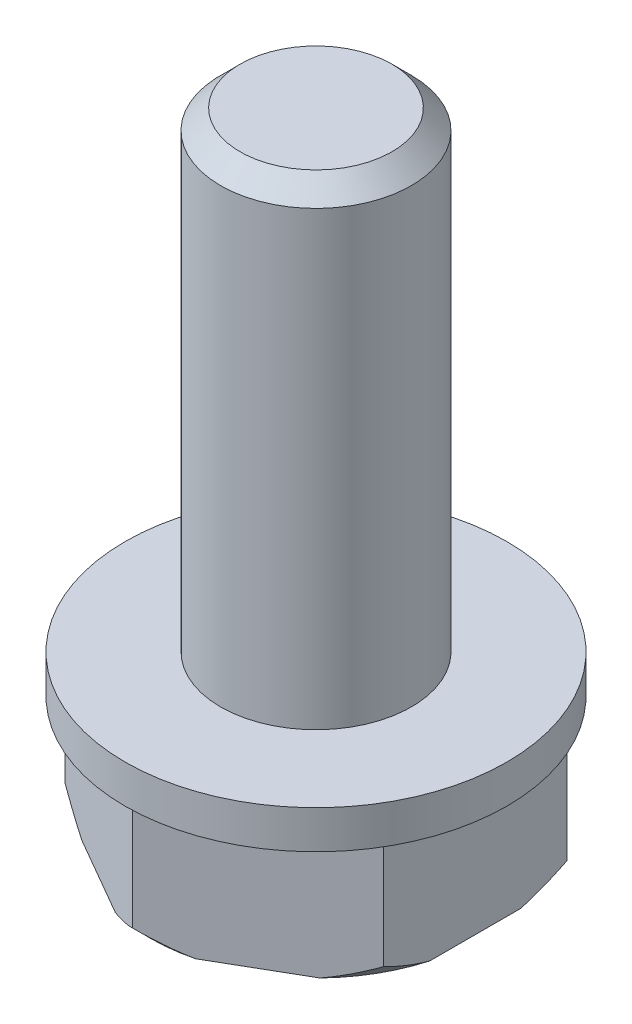
ISO-10303-21;
HEADER;
FILE_DESCRIPTION(('STEP AP214'),'2;1');
FILE_NAME('part.step','',(''),(''),'','','');
FILE_SCHEMA(('AUTOMOTIVE_DESIGN { 1 0 10303 214 1 1 1 1 }'));
ENDSEC;
DATA;
#1=APPLICATION_CONTEXT('core data for automotive mechanical design processes');
#2=APPLICATION_PROTOCOL_DEFINITION('international standard','automotive_design',2000,#1);
#3=PRODUCT_CONTEXT('',#1,'mechanical');
#4=PRODUCT('Part','Part','',(#3));
#5=PRODUCT_RELATED_PRODUCT_CATEGORY('part','',(#4));
#6=PRODUCT_DEFINITION_FORMATION('','',#4);
#7=PRODUCT_DEFINITION_CONTEXT('part definition',#1,'design');
#8=PRODUCT_DEFINITION('design','',#6,#7);
#9=PRODUCT_DEFINITION_SHAPE('','',#8);
#10=(LENGTH_UNIT() NAMED_UNIT(*) SI_UNIT(.MILLI.,.METRE.));
#11=(NAMED_UNIT(*) PLANE_ANGLE_UNIT() SI_UNIT($,.RADIAN.));
#12=(NAMED_UNIT(*) SI_UNIT($,.STERADIAN.) SOLID_ANGLE_UNIT());
#13=UNCERTAINTY_MEASURE_WITH_UNIT(LENGTH_MEASURE(1.E-05),#10,'distance_accuracy_value','');
#14=(GEOMETRIC_REPRESENTATION_CONTEXT(3) GLOBAL_UNCERTAINTY_ASSIGNED_CONTEXT((#13)) GLOBAL_UNIT_ASSIGNED_CONTEXT((#10,
#11,#12)) REPRESENTATION_CONTEXT('',''));
#15=CARTESIAN_POINT('',(0.,0.,0.));
#16=DIRECTION('',(0.,0.,1.));
#17=DIRECTION('',(1.,0.,0.));
#18=AXIS2_PLACEMENT_3D('',#15,#16,#17);
#19=CARTESIAN_POINT('',(22.6776695296637,96.,14.7909181837156));
#20=DIRECTION('',(-0.5,0.,0.866025403784439));
#21=DIRECTION('',(0.866025403784439,0.,0.5));
#22=AXIS2_PLACEMENT_3D('',#19,#20,#21);
#23=PLANE('',#22);
#24=DIRECTION('',(0.,-1.,0.));
#25=VECTOR('',#24,1.);
#26=CARTESIAN_POINT('',(22.6776695296637,96.,14.7909181837156));
#27=LINE('',#26,#25);
#28=CARTESIAN_POINT('',(22.6776695296637,50.,14.7909181837156));
#29=VERTEX_POINT('',#28);
#30=CARTESIAN_POINT('',(22.6776695296637,46.5735026918963,14.7909181837156));
#31=VERTEX_POINT('',#30);
#32=EDGE_CURVE('E11',#29,#31,#27,.T.);
#33=ORIENTED_EDGE('',*,*,#32,.T.);
#34=CARTESIAN_POINT('',(21.414601217349,46.,14.0616853535958));
#35=CARTESIAN_POINT('',(21.4664537594648,46.0164440766261,14.091623938227));
#36=CARTESIAN_POINT('',(21.5180895158105,46.0337687545802,14.1214486324146));
#37=CARTESIAN_POINT('',(21.6214874574526,46.0702823086314,14.1811796574282));
#38=CARTESIAN_POINT('',(21.6732446970938,46.0894897238432,14.2110832271335));
#39=CARTESIAN_POINT('',(21.7769756621481,46.1297670931507,14.2710096812821));
#40=CARTESIAN_POINT('',(21.8289432219275,46.1508582920278,14.3010289273304));
#41=CARTESIAN_POINT('',(21.9331790081629,46.1949003649628,14.3612296351021));
#42=CARTESIAN_POINT('',(21.9854399260141,46.2178745106764,14.3914067018588));
#43=CARTESIAN_POINT('',(22.0903392794409,46.2656807395659,14.4519664939412));
#44=CARTESIAN_POINT('',(22.1429693499514,46.2905375181192,14.4823441822286));
#45=CARTESIAN_POINT('',(22.2486773209186,46.3421079012049,14.5433494931069));
#46=CARTESIAN_POINT('',(22.3017459168783,46.3688470805479,14.5739715894766));
#47=CARTESIAN_POINT('',(22.4083946755418,46.4241810640024,14.6355096377957));
#48=CARTESIAN_POINT('',(22.4619647196343,46.4528018406309,14.6664197250956));
#49=CARTESIAN_POINT('',(22.56967482855,46.5119007649667,14.7285774640249));
#50=CARTESIAN_POINT('',(22.6238041115768,46.5424049416879,14.7598190718213));
#51=CARTESIAN_POINT('',(22.6776695296637,46.5735026918963,14.7909181837156));
#52=B_SPLINE_CURVE_WITH_KNOTS('',3,(#34,#35,#36,#37,#38,#39,#40,#41,#42,#43,#44,#45,#46,#47,#48,
#49,#50,#51),.UNSPECIFIED.,.F.,.F.,(4,2,2,2,2,2,2,2,4),(0.,0.186265222277087,0.374595608167021,
0.565412784427934,0.759111232115696,0.956057798253862,1.15659171756842,1.36102506604504,
1.56964356219137),.UNSPECIFIED.);
#53=CARTESIAN_POINT('',(21.414601217349,46.,14.0616853535958));
#54=VERTEX_POINT('',#53);
#55=EDGE_CURVE('E258',#54,#31,#52,.T.);
#56=ORIENTED_EDGE('',*,*,#55,.F.);
#57=DIRECTION('',(0.866025403784439,0.,0.5));
#58=VECTOR('',#57,1.);
#59=CARTESIAN_POINT('',(24.0776695296637,46.,15.5992085605811));
#60=LINE('',#59,#58);
#61=CARTESIAN_POINT('',(18.9407378419784,46.,12.6333996678872));
#62=VERTEX_POINT('',#61);
#63=EDGE_CURVE('E263',#62,#54,#60,.T.);
#64=ORIENTED_EDGE('',*,*,#63,.F.);
#65=CARTESIAN_POINT('',(17.6776695296637,46.5735026918963,11.9041668377674));
#66=CARTESIAN_POINT('',(17.7315348596427,46.542404941688,11.9352661022691));
#67=CARTESIAN_POINT('',(17.7856555271629,46.5119007649667,11.9665226325607));
#68=CARTESIAN_POINT('',(17.8933407625753,46.4528018406309,12.0287234536614));
#69=CARTESIAN_POINT('',(17.9468947054565,46.4241810640024,12.0596614290774));
#70=CARTESIAN_POINT('',(18.0535125979319,46.3688470805479,12.1212529392026));
#71=CARTESIAN_POINT('',(18.1065664092851,46.3421079012049,12.1519006432619));
#72=CARTESIAN_POINT('',(18.212252543755,46.2905375181192,12.2129437760629));
#73=CARTESIAN_POINT('',(18.2648754287754,46.2656807395659,12.2433339099843));
#74=CARTESIAN_POINT('',(18.3697714238801,46.2178745106764,12.3038995188512));
#75=CARTESIAN_POINT('',(18.4220359892286,46.1949003649628,12.3340702679571));
#76=CARTESIAN_POINT('',(18.5262892246024,46.1508582920278,12.3942407529346));
#77=CARTESIAN_POINT('',(18.5782704341725,46.1297670931507,12.424236356852));
#78=CARTESIAN_POINT('',(18.682033748351,46.0894897238432,12.4841067806739));
#79=CARTESIAN_POINT('',(18.7338096192003,46.0702823086314,12.5139780801803));
#80=CARTESIAN_POINT('',(18.8372371750771,46.0337687545802,12.5736578118346));
#81=CARTESIAN_POINT('',(18.8888839960765,46.0164440766261,12.6034633414798));
#82=CARTESIAN_POINT('',(18.9407378419784,46.,12.6333996678872));
#83=B_SPLINE_CURVE_WITH_KNOTS('',3,(#65,#66,#67,#68,#69,#70,#71,#72,#73,#74,#75,#76,#77,#78,#79,
#80,#81,#82),.UNSPECIFIED.,.F.,.F.,(4,2,2,2,2,2,2,2,4),(0.,0.208618496146341,0.41305184462297,
0.61358576393753,0.810532330075703,1.00423077776347,1.19504795402438,1.38337833991431,
1.56964356219139),.UNSPECIFIED.);
#84=CARTESIAN_POINT('',(17.6776695296637,46.5735026918963,11.9041668377674));
#85=VERTEX_POINT('',#84);
#86=EDGE_CURVE('E385',#85,#62,#83,.T.);
#87=ORIENTED_EDGE('',*,*,#86,.F.);
#88=DIRECTION('',(0.,-1.,0.));
#89=VECTOR('',#88,1.);
#90=CARTESIAN_POINT('',(17.6776695296637,96.,11.9041668377674));
#91=LINE('',#90,#89);
#92=CARTESIAN_POINT('',(17.6776695296637,50.,11.9041668377674));
#93=VERTEX_POINT('',#92);
#94=EDGE_CURVE('E283',#93,#85,#91,.T.);
#95=ORIENTED_EDGE('',*,*,#94,.F.);
#96=DIRECTION('',(-0.866025403784439,0.,-0.5));
#97=VECTOR('',#96,1.);
#98=CARTESIAN_POINT('',(22.4276695296637,50.,14.6465806164181));
#99=LINE('',#98,#97);
#100=EDGE_CURVE('E396',#29,#93,#99,.T.);
#101=ORIENTED_EDGE('',*,*,#100,.F.);
#102=EDGE_LOOP('',(#33,#56,#64,#87,#95,#101));
#103=FACE_BOUND('',#102,.T.);
#104=ADVANCED_FACE('F16',(#103),#23,.F.);
#105=CARTESIAN_POINT('',(22.6776695296637,96.,20.5644208756118));
#106=DIRECTION('',(-1.,0.,0.));
#107=DIRECTION('',(0.,0.,1.));
#108=AXIS2_PLACEMENT_3D('',#105,#106,#107);
#109=PLANE('',#108);
#110=DIRECTION('',(0.,-1.,0.));
#111=VECTOR('',#110,1.);
#112=CARTESIAN_POINT('',(22.6776695296637,96.,20.5644208756118));
#113=LINE('',#112,#111);
#114=CARTESIAN_POINT('',(22.6776695296637,50.,20.5644208756118));
#115=VERTEX_POINT('',#114);
#116=CARTESIAN_POINT('',(22.6776695296637,46.5735026918963,20.5644208756118));
#117=VERTEX_POINT('',#116);
#118=EDGE_CURVE('E212',#115,#117,#113,.T.);
#119=ORIENTED_EDGE('',*,*,#118,.T.);
#120=CARTESIAN_POINT('',(22.6776695296637,46.,19.1059552153723));
#121=CARTESIAN_POINT('',(22.6776682258776,46.0164440766261,19.1658301264109));
#122=CARTESIAN_POINT('',(22.6776571612239,46.0337687545802,19.2254603502437));
#123=CARTESIAN_POINT('',(22.6776275469891,46.0702823086314,19.3448711069116));
#124=CARTESIAN_POINT('',(22.6776089157811,46.0894897238432,19.4046459761233));
#125=CARTESIAN_POINT('',(22.6775765666569,46.1297670931507,19.5244428540937));
#126=CARTESIAN_POINT('',(22.6775629168662,46.1508582920278,19.5844577040596));
#127=CARTESIAN_POINT('',(22.6775454677278,46.1949003649628,19.7048288968087));
#128=CARTESIAN_POINT('',(22.6775418202304,46.2178745106764,19.7651767126713));
#129=CARTESIAN_POINT('',(22.6775451785526,46.2656807395659,19.8863021136206));
#130=CARTESIAN_POINT('',(22.6775523640427,46.2905375181192,19.9470699358293));
#131=CARTESIAN_POINT('',(22.67757420054,46.3421079012049,20.0691183795086));
#132=CARTESIAN_POINT('',(22.6775889851464,46.3688470805479,20.1303881799377));
#133=CARTESIAN_POINT('',(22.6776198513346,46.4241810640024,20.2535177383819));
#134=CARTESIAN_POINT('',(22.677635952546,46.4528018406309,20.3153658010979));
#135=CARTESIAN_POINT('',(22.6776608260492,46.5119007649667,20.4397243611279));
#136=CARTESIAN_POINT('',(22.6776694415558,46.542404941688,20.502222499216));
#137=CARTESIAN_POINT('',(22.6776695296637,46.5735026918963,20.5644208756118));
#138=B_SPLINE_CURVE_WITH_KNOTS('',3,(#120,#121,#122,#123,#124,#125,#126,#127,#128,#129,#130,
#131,#132,#133,#134,#135,#136,#137),.UNSPECIFIED.,.F.,.F.,(4,2,2,2,2,2,2,2,4),(0.,
0.186265222277086,0.37459560816702,0.565412784427932,0.759111232115696,0.956057798253867,
1.15659171756843,1.36102506604505,1.56964356219139),.UNSPECIFIED.);
#139=CARTESIAN_POINT('',(22.6776695296637,46.,19.1059552153723));
#140=VERTEX_POINT('',#139);
#141=EDGE_CURVE('E29',#140,#117,#138,.T.);
#142=ORIENTED_EDGE('',*,*,#141,.F.);
#143=DIRECTION('',(0.,0.,1.));
#144=VECTOR('',#143,1.);
#145=CARTESIAN_POINT('',(22.6776695296637,46.,17.6776695296637));
#146=LINE('',#145,#144);
#147=CARTESIAN_POINT('',(22.6776695296637,46.,16.2493838439551));
#148=VERTEX_POINT('',#147);
#149=EDGE_CURVE('E196',#148,#140,#146,.T.);
#150=ORIENTED_EDGE('',*,*,#149,.F.);
#151=CARTESIAN_POINT('',(22.6776695296637,46.5735026918963,14.7909181837156));
#152=CARTESIAN_POINT('',(22.6776694415558,46.5424049416879,14.8531165601115));
#153=CARTESIAN_POINT('',(22.6776608260492,46.5119007649667,14.9156146981996));
#154=CARTESIAN_POINT('',(22.677635952546,46.4528018406309,15.0399732582295));
#155=CARTESIAN_POINT('',(22.6776198513346,46.4241810640024,15.1018213209455));
#156=CARTESIAN_POINT('',(22.6775889851464,46.3688470805479,15.2249508793897));
#157=CARTESIAN_POINT('',(22.67757420054,46.3421079012049,15.2862206798188));
#158=CARTESIAN_POINT('',(22.6775523640427,46.2905375181192,15.4082691234981));
#159=CARTESIAN_POINT('',(22.6775451785526,46.2656807395659,15.4690369457068));
#160=CARTESIAN_POINT('',(22.6775418202304,46.2178745106764,15.5901623466562));
#161=CARTESIAN_POINT('',(22.6775454677278,46.1949003649628,15.6505101625187));
#162=CARTESIAN_POINT('',(22.6775629168662,46.1508582920278,15.7708813552679));
#163=CARTESIAN_POINT('',(22.6775765666568,46.1297670931507,15.8308962052337));
#164=CARTESIAN_POINT('',(22.6776089157811,46.0894897238432,15.9506930832041));
#165=CARTESIAN_POINT('',(22.6776275469891,46.0702823086314,16.0104679524158));
#166=CARTESIAN_POINT('',(22.6776571612239,46.0337687545802,16.1298787090837));
#167=CARTESIAN_POINT('',(22.6776682258776,46.0164440766261,16.1895089329165));
#168=CARTESIAN_POINT('',(22.6776695296637,46.,16.2493838439551));
#169=B_SPLINE_CURVE_WITH_KNOTS('',3,(#151,#152,#153,#154,#155,#156,#157,#158,#159,#160,#161,
#162,#163,#164,#165,#166,#167,#168),.UNSPECIFIED.,.F.,.F.,(4,2,2,2,2,2,2,2,4),(0.,
0.208618496146355,0.413051844622992,0.613585763937557,0.810532330075726,1.00423077776349,
1.19504795402439,1.38337833991431,1.56964356219138),.UNSPECIFIED.);
#170=EDGE_CURVE('E223',#31,#148,#169,.T.);
#171=ORIENTED_EDGE('',*,*,#170,.F.);
#172=ORIENTED_EDGE('',*,*,#32,.F.);
#173=DIRECTION('',(0.,0.,-1.));
#174=VECTOR('',#173,1.);
#175=CARTESIAN_POINT('',(22.6776695296637,50.,17.6776695296637));
#176=LINE('',#175,#174);
#177=EDGE_CURVE('E393',#115,#29,#176,.T.);
#178=ORIENTED_EDGE('',*,*,#177,.F.);
#179=EDGE_LOOP('',(#119,#142,#150,#171,#172,#178));
#180=FACE_BOUND('',#179,.T.);
#181=ADVANCED_FACE('F273',(#180),#109,.F.);
#182=CARTESIAN_POINT('',(17.6776695296637,46.8,17.6776695296637));
#183=DIRECTION('',(0.,1.,0.));
#184=DIRECTION('',(0.,0.,1.));
#185=AXIS2_PLACEMENT_3D('',#182,#183,#184);
#186=CONICAL_SURFACE('',#185,6.,0.785398163397448);
#187=CARTESIAN_POINT('',(17.6776695296637,46.,17.6776695296637));
#188=DIRECTION('',(0.,-1.,0.));
#189=DIRECTION('',(0.,0.,-1.));
#190=AXIS2_PLACEMENT_3D('',#187,#188,#189);
#191=CIRCLE('',#190,5.2);
#192=CARTESIAN_POINT('',(21.414601217349,46.,21.2936537057316));
#193=VERTEX_POINT('',#192);
#194=EDGE_CURVE('E191',#140,#193,#191,.T.);
#195=ORIENTED_EDGE('',*,*,#194,.F.);
#196=ORIENTED_EDGE('',*,*,#141,.T.);
#197=CARTESIAN_POINT('',(22.6776695296637,46.5735026918963,20.5644208756118));
#198=CARTESIAN_POINT('',(22.6238041115768,46.542404941688,20.5955199875061));
#199=CARTESIAN_POINT('',(22.5696748285499,46.5119007649667,20.6267615953026));
#200=CARTESIAN_POINT('',(22.4619647196343,46.4528018406309,20.6889193342319));
#201=CARTESIAN_POINT('',(22.4083946755417,46.4241810640024,20.7198294215318));
#202=CARTESIAN_POINT('',(22.3017459168782,46.3688470805479,20.7813674698508));
#203=CARTESIAN_POINT('',(22.2486773209186,46.3421079012049,20.8119895662206));
#204=CARTESIAN_POINT('',(22.1429693499514,46.2905375181192,20.8729948770989));
#205=CARTESIAN_POINT('',(22.0903392794409,46.2656807395659,20.9033725653862));
#206=CARTESIAN_POINT('',(21.9854399260141,46.2178745106764,20.9639323574686));
#207=CARTESIAN_POINT('',(21.9331790081629,46.1949003649628,20.9941094242253));
#208=CARTESIAN_POINT('',(21.8289432219275,46.1508582920278,21.054310131997));
#209=CARTESIAN_POINT('',(21.7769756621481,46.1297670931507,21.0843293780454));
#210=CARTESIAN_POINT('',(21.6732446970938,46.0894897238432,21.1442558321939));
#211=CARTESIAN_POINT('',(21.6214874574525,46.0702823086314,21.1741594018992));
#212=CARTESIAN_POINT('',(21.5180895158105,46.0337687545802,21.2338904269128));
#213=CARTESIAN_POINT('',(21.4664537594648,46.0164440766261,21.2637151211004));
#214=CARTESIAN_POINT('',(21.414601217349,46.,21.2936537057316));
#215=B_SPLINE_CURVE_WITH_KNOTS('',3,(#197,#198,#199,#200,#201,#202,#203,#204,#205,#206,#207,
#208,#209,#210,#211,#212,#213,#214),.UNSPECIFIED.,.F.,.F.,(4,2,2,2,2,2,2,2,4),(0.,
0.208618496146344,0.413051844622972,0.613585763937531,0.810532330075702,1.00423077776346,
1.19504795402437,1.3833783399143,1.56964356219137),.UNSPECIFIED.);
#216=EDGE_CURVE('E216',#117,#193,#215,.T.);
#217=ORIENTED_EDGE('',*,*,#216,.T.);
#218=EDGE_LOOP('',(#195,#196,#217));
#219=FACE_BOUND('',#218,.T.);
#220=ADVANCED_FACE('F18',(#219),#186,.T.);
#221=CARTESIAN_POINT('',(17.6776695296637,46.8,17.6776695296637));
#222=DIRECTION('',(0.,1.,0.));
#223=DIRECTION('',(0.,0.,1.));
#224=AXIS2_PLACEMENT_3D('',#221,#222,#223);
#225=CONICAL_SURFACE('',#224,6.,0.785398163397448);
#226=CARTESIAN_POINT('',(17.6776695296637,46.,17.6776695296637));
#227=DIRECTION('',(0.,-1.,0.));
#228=DIRECTION('',(0.,0.,-1.));
#229=AXIS2_PLACEMENT_3D('',#226,#227,#228);
#230=CIRCLE('',#229,5.2);
#231=EDGE_CURVE('E200',#54,#148,#230,.T.);
#232=ORIENTED_EDGE('',*,*,#231,.F.);
#233=ORIENTED_EDGE('',*,*,#55,.T.);
#234=ORIENTED_EDGE('',*,*,#170,.T.);
#235=EDGE_LOOP('',(#232,#233,#234));
#236=FACE_BOUND('',#235,.T.);
#237=ADVANCED_FACE('F230',(#236),#225,.T.);
#238=CARTESIAN_POINT('',(17.6776695296637,46.8,17.6776695296637));
#239=DIRECTION('',(0.,1.,0.));
#240=DIRECTION('',(0.,0.,1.));
#241=AXIS2_PLACEMENT_3D('',#238,#239,#240);
#242=CONICAL_SURFACE('',#241,6.,0.785398163397448);
#243=CARTESIAN_POINT('',(17.6776695296637,46.,17.6776695296637));
#244=DIRECTION('',(0.,-1.,0.));
#245=DIRECTION('',(0.,0.,-1.));
#246=AXIS2_PLACEMENT_3D('',#243,#244,#245);
#247=CIRCLE('',#246,5.2);
#248=CARTESIAN_POINT('',(16.414601217349,46.,12.6333996678872));
#249=VERTEX_POINT('',#248);
#250=EDGE_CURVE('E295',#249,#62,#247,.T.);
#251=ORIENTED_EDGE('',*,*,#250,.F.);
#252=CARTESIAN_POINT('',(16.414601217349,46.,12.6333996678872));
#253=CARTESIAN_POINT('',(16.4664550632509,46.0164440766261,12.6034633414798));
#254=CARTESIAN_POINT('',(16.5181018842503,46.0337687545802,12.5736578118346));
#255=CARTESIAN_POINT('',(16.6215294401272,46.0702823086314,12.5139780801803));
#256=CARTESIAN_POINT('',(16.6733053109764,46.0894897238432,12.4841067806739));
#257=CARTESIAN_POINT('',(16.777068625155,46.1297670931507,12.424236356852));
#258=CARTESIAN_POINT('',(16.829049834725,46.1508582920278,12.3942407529346));
#259=CARTESIAN_POINT('',(16.9333030700988,46.1949003649628,12.3340702679571));
#260=CARTESIAN_POINT('',(16.9855676354474,46.2178745106764,12.3038995188512));
#261=CARTESIAN_POINT('',(17.090463630552,46.2656807395659,12.2433339099842));
#262=CARTESIAN_POINT('',(17.1430865155724,46.2905375181192,12.2129437760629));
#263=CARTESIAN_POINT('',(17.2487726500424,46.3421079012049,12.1519006432619));
#264=CARTESIAN_POINT('',(17.3018264613956,46.3688470805479,12.1212529392026));
#265=CARTESIAN_POINT('',(17.4084443538709,46.4241810640024,12.0596614290774));
#266=CARTESIAN_POINT('',(17.4619982967521,46.4528018406309,12.0287234536614));
#267=CARTESIAN_POINT('',(17.5696835321645,46.5119007649667,11.9665226325607));
#268=CARTESIAN_POINT('',(17.6238041996847,46.5424049416879,11.9352661022691));
#269=CARTESIAN_POINT('',(17.6776695296637,46.5735026918963,11.9041668377675));
#270=B_SPLINE_CURVE_WITH_KNOTS('',3,(#252,#253,#254,#255,#256,#257,#258,#259,#260,#261,#262,
#263,#264,#265,#266,#267,#268,#269),.UNSPECIFIED.,.F.,.F.,(4,2,2,2,2,2,2,2,4),(0.,
0.186265222277093,0.37459560816703,0.565412784427945,0.759111232115714,0.956057798253883,
1.15659171756844,1.36102506604505,1.56964356219139),.UNSPECIFIED.);
#271=EDGE_CURVE('E291',#249,#85,#270,.T.);
#272=ORIENTED_EDGE('',*,*,#271,.T.);
#273=ORIENTED_EDGE('',*,*,#86,.T.);
#274=EDGE_LOOP('',(#251,#272,#273));
#275=FACE_BOUND('',#274,.T.);
#276=ADVANCED_FACE('F239',(#275),#242,.T.);
#277=CARTESIAN_POINT('',(17.6776695296637,51.2,17.6776695296637));
#278=DIRECTION('',(0.,-1.,0.));
#279=DIRECTION('',(0.,0.,-1.));
#280=AXIS2_PLACEMENT_3D('',#277,#278,#279);
#281=PLANE('',#280);
#282=CARTESIAN_POINT('',(17.6776695296637,51.2,17.6776695296637));
#283=DIRECTION('',(0.,-1.,0.));
#284=DIRECTION('',(0.,0.,-1.));
#285=AXIS2_PLACEMENT_3D('',#282,#283,#284);
#286=CIRCLE('',#285,3.);
#287=CARTESIAN_POINT('',(17.6776695296637,51.2,14.6776695296637));
#288=VERTEX_POINT('',#287);
#289=EDGE_CURVE('E195',#288,#288,#286,.T.);
#290=ORIENTED_EDGE('',*,*,#289,.T.);
#291=EDGE_LOOP('',(#290));
#292=FACE_BOUND('',#291,.T.);
#293=CARTESIAN_POINT('',(17.6776695296637,51.2,17.6776695296637));
#294=DIRECTION('',(0.,-1.,0.));
#295=DIRECTION('',(0.,0.,-1.));
#296=AXIS2_PLACEMENT_3D('',#293,#294,#295);
#297=CIRCLE('',#296,6.);
#298=CARTESIAN_POINT('',(17.6776695296637,51.2,11.6776695296637));
#299=VERTEX_POINT('',#298);
#300=EDGE_CURVE('E384',#299,#299,#297,.T.);
#301=ORIENTED_EDGE('',*,*,#300,.F.);
#302=EDGE_LOOP('',(#301));
#303=FACE_BOUND('',#302,.T.);
#304=ADVANCED_FACE('F320',(#292,#303),#281,.F.);
#305=CARTESIAN_POINT('',(17.6776695296637,46.8,17.6776695296637));
#306=DIRECTION('',(0.,1.,0.));
#307=DIRECTION('',(0.,0.,1.));
#308=AXIS2_PLACEMENT_3D('',#305,#306,#307);
#309=CONICAL_SURFACE('',#308,6.,0.785398163397448);
#310=CARTESIAN_POINT('',(17.6776695296637,46.,17.6776695296637));
#311=DIRECTION('',(0.,-1.,0.));
#312=DIRECTION('',(0.,0.,-1.));
#313=AXIS2_PLACEMENT_3D('',#310,#311,#312);
#314=CIRCLE('',#313,5.2);
#315=CARTESIAN_POINT('',(12.6776695296637,46.,16.2493838439551));
#316=VERTEX_POINT('',#315);
#317=CARTESIAN_POINT('',(13.9407378419784,46.,14.0616853535958));
#318=VERTEX_POINT('',#317);
#319=EDGE_CURVE('E345',#316,#318,#314,.T.);
#320=ORIENTED_EDGE('',*,*,#319,.F.);
#321=CARTESIAN_POINT('',(12.6776695296637,46.,16.2493838439551));
#322=CARTESIAN_POINT('',(12.6776708334498,46.0164440766261,16.1895089329165));
#323=CARTESIAN_POINT('',(12.6776818981035,46.0337687545802,16.1298787090837));
#324=CARTESIAN_POINT('',(12.6777115123383,46.0702823086314,16.0104679524158));
#325=CARTESIAN_POINT('',(12.6777301435463,46.0894897238432,15.9506930832041));
#326=CARTESIAN_POINT('',(12.6777624926705,46.1297670931507,15.8308962052337));
#327=CARTESIAN_POINT('',(12.6777761424612,46.1508582920278,15.7708813552678));
#328=CARTESIAN_POINT('',(12.6777935915996,46.1949003649628,15.6505101625187));
#329=CARTESIAN_POINT('',(12.677797239097,46.2178745106764,15.5901623466562));
#330=CARTESIAN_POINT('',(12.6777938807748,46.2656807395659,15.4690369457068));
#331=CARTESIAN_POINT('',(12.6777866952847,46.2905375181192,15.4082691234981));
#332=CARTESIAN_POINT('',(12.6777648587874,46.3421079012049,15.2862206798188));
#333=CARTESIAN_POINT('',(12.677750074181,46.3688470805479,15.2249508793897));
#334=CARTESIAN_POINT('',(12.6777192079928,46.4241810640024,15.1018213209455));
#335=CARTESIAN_POINT('',(12.6777031067814,46.4528018406309,15.0399732582295));
#336=CARTESIAN_POINT('',(12.6776782332782,46.5119007649667,14.9156146981995));
#337=CARTESIAN_POINT('',(12.6776696177716,46.542404941688,14.8531165601114));
#338=CARTESIAN_POINT('',(12.6776695296637,46.5735026918963,14.7909181837156));
#339=B_SPLINE_CURVE_WITH_KNOTS('',3,(#321,#322,#323,#324,#325,#326,#327,#328,#329,#330,#331,
#332,#333,#334,#335,#336,#337,#338),.UNSPECIFIED.,.F.,.F.,(4,2,2,2,2,2,2,2,4),(0.,
0.186265222277089,0.37459560816702,0.565412784427928,0.759111232115701,0.95605779825387,
1.15659171756843,1.36102506604505,1.56964356219139),.UNSPECIFIED.);
#340=CARTESIAN_POINT('',(12.6776695296637,46.5735026918963,14.7909181837156));
#341=VERTEX_POINT('',#340);
#342=EDGE_CURVE('E292',#316,#341,#339,.T.);
#343=ORIENTED_EDGE('',*,*,#342,.T.);
#344=CARTESIAN_POINT('',(12.6776695296637,46.5735026918963,14.7909181837156));
#345=CARTESIAN_POINT('',(12.7315349477506,46.542404941688,14.7598190718213));
#346=CARTESIAN_POINT('',(12.7856642307775,46.5119007649667,14.7285774640249));
#347=CARTESIAN_POINT('',(12.8933743396931,46.4528018406309,14.6664197250956));
#348=CARTESIAN_POINT('',(12.9469443837857,46.4241810640024,14.6355096377956));
#349=CARTESIAN_POINT('',(13.0535931424492,46.3688470805479,14.5739715894766));
#350=CARTESIAN_POINT('',(13.1066617384088,46.3421079012049,14.5433494931068));
#351=CARTESIAN_POINT('',(13.212369709376,46.2905375181192,14.4823441822286));
#352=CARTESIAN_POINT('',(13.2649997798865,46.2656807395659,14.4519664939412));
#353=CARTESIAN_POINT('',(13.3698991333133,46.2178745106764,14.3914067018588));
#354=CARTESIAN_POINT('',(13.4221600511645,46.1949003649628,14.3612296351021));
#355=CARTESIAN_POINT('',(13.5263958373999,46.1508582920278,14.3010289273304));
#356=CARTESIAN_POINT('',(13.5783633971793,46.1297670931507,14.2710096812821));
#357=CARTESIAN_POINT('',(13.6820943622336,46.0894897238432,14.2110832271335));
#358=CARTESIAN_POINT('',(13.7338516018748,46.0702823086314,14.1811796574282));
#359=CARTESIAN_POINT('',(13.8372495435169,46.0337687545802,14.1214486324146));
#360=CARTESIAN_POINT('',(13.8888852998626,46.0164440766261,14.091623938227));
#361=CARTESIAN_POINT('',(13.9407378419784,46.,14.0616853535958));
#362=B_SPLINE_CURVE_WITH_KNOTS('',3,(#344,#345,#346,#347,#348,#349,#350,#351,#352,#353,#354,
#355,#356,#357,#358,#359,#360,#361),.UNSPECIFIED.,.F.,.F.,(4,2,2,2,2,2,2,2,4),(0.,
0.208618496146337,0.413051844622964,0.613585763937518,0.810532330075692,1.00423077776345,
1.19504795402436,1.38337833991429,1.56964356219137),.UNSPECIFIED.);
#363=EDGE_CURVE('E305',#341,#318,#362,.T.);
#364=ORIENTED_EDGE('',*,*,#363,.T.);
#365=EDGE_LOOP('',(#320,#343,#364));
#366=FACE_BOUND('',#365,.T.);
#367=ADVANCED_FACE('F311',(#366),#309,.T.);
#368=CARTESIAN_POINT('',(17.6776695296637,50.,17.6776695296637));
#369=DIRECTION('',(0.,-1.,0.));
#370=DIRECTION('',(0.,0.,-1.));
#371=AXIS2_PLACEMENT_3D('',#368,#369,#370);
#372=CYLINDRICAL_SURFACE('',#371,6.);
#373=ORIENTED_EDGE('',*,*,#300,.T.);
#374=EDGE_LOOP('',(#373));
#375=FACE_BOUND('',#374,.T.);
#376=CARTESIAN_POINT('',(17.6776695296637,50.,17.6776695296637));
#377=DIRECTION('',(0.,-1.,0.));
#378=DIRECTION('',(0.,0.,-1.));
#379=AXIS2_PLACEMENT_3D('',#376,#377,#378);
#380=CIRCLE('',#379,6.);
#381=CARTESIAN_POINT('',(17.6776695296637,50.,11.6776695296637));
#382=VERTEX_POINT('',#381);
#383=EDGE_CURVE('E480',#382,#382,#380,.T.);
#384=ORIENTED_EDGE('',*,*,#383,.F.);
#385=EDGE_LOOP('',(#384));
#386=FACE_BOUND('',#385,.T.);
#387=ADVANCED_FACE('F319',(#375,#386),#372,.T.);
#388=CARTESIAN_POINT('',(17.6776695296637,96.,11.9041668377674));
#389=DIRECTION('',(0.5,0.,0.866025403784439));
#390=DIRECTION('',(0.866025403784439,0.,-0.5));
#391=AXIS2_PLACEMENT_3D('',#388,#389,#390);
#392=PLANE('',#391);
#393=ORIENTED_EDGE('',*,*,#94,.T.);
#394=ORIENTED_EDGE('',*,*,#271,.F.);
#395=DIRECTION('',(0.866025403784439,0.,-0.5));
#396=VECTOR('',#395,1.);
#397=CARTESIAN_POINT('',(19.0776695296637,46.,11.0958764609019));
#398=LINE('',#397,#396);
#399=EDGE_CURVE('E298',#318,#249,#398,.T.);
#400=ORIENTED_EDGE('',*,*,#399,.F.);
#401=ORIENTED_EDGE('',*,*,#363,.F.);
#402=DIRECTION('',(0.,-1.,0.));
#403=VECTOR('',#402,1.);
#404=CARTESIAN_POINT('',(12.6776695296637,96.,14.7909181837156));
#405=LINE('',#404,#403);
#406=CARTESIAN_POINT('',(12.6776695296637,50.,14.7909181837156));
#407=VERTEX_POINT('',#406);
#408=EDGE_CURVE('E482',#407,#341,#405,.T.);
#409=ORIENTED_EDGE('',*,*,#408,.F.);
#410=DIRECTION('',(-0.866025403784439,0.,0.5));
#411=VECTOR('',#410,1.);
#412=CARTESIAN_POINT('',(17.4276695296637,50.,12.0485044050648));
#413=LINE('',#412,#411);
#414=EDGE_CURVE('E400',#93,#407,#413,.T.);
#415=ORIENTED_EDGE('',*,*,#414,.F.);
#416=EDGE_LOOP('',(#393,#394,#400,#401,#409,#415));
#417=FACE_BOUND('',#416,.T.);
#418=ADVANCED_FACE('F167',(#417),#392,.F.);
#419=CARTESIAN_POINT('',(12.6776695296637,96.,14.7909181837156));
#420=DIRECTION('',(1.,0.,0.));
#421=DIRECTION('',(0.,0.,-1.));
#422=AXIS2_PLACEMENT_3D('',#419,#420,#421);
#423=PLANE('',#422);
#424=ORIENTED_EDGE('',*,*,#408,.T.);
#425=ORIENTED_EDGE('',*,*,#342,.F.);
#426=DIRECTION('',(0.,0.,-1.));
#427=VECTOR('',#426,1.);
#428=CARTESIAN_POINT('',(12.6776695296637,46.,17.6776695296637));
#429=LINE('',#428,#427);
#430=CARTESIAN_POINT('',(12.6776695296637,46.,19.1059552153723));
#431=VERTEX_POINT('',#430);
#432=EDGE_CURVE('E130',#431,#316,#429,.T.);
#433=ORIENTED_EDGE('',*,*,#432,.F.);
#434=CARTESIAN_POINT('',(12.6776695296637,46.5735026918963,20.5644208756118));
#435=CARTESIAN_POINT('',(12.6776696177716,46.5424049416879,20.502222499216));
#436=CARTESIAN_POINT('',(12.6776782332782,46.5119007649667,20.4397243611279));
#437=CARTESIAN_POINT('',(12.6777031067814,46.4528018406309,20.3153658010979));
#438=CARTESIAN_POINT('',(12.6777192079928,46.4241810640024,20.2535177383819));
#439=CARTESIAN_POINT('',(12.677750074181,46.3688470805479,20.1303881799377));
#440=CARTESIAN_POINT('',(12.6777648587874,46.3421079012049,20.0691183795086));
#441=CARTESIAN_POINT('',(12.6777866952847,46.2905375181192,19.9470699358293));
#442=CARTESIAN_POINT('',(12.6777938807748,46.2656807395659,19.8863021136206));
#443=CARTESIAN_POINT('',(12.677797239097,46.2178745106764,19.7651767126712));
#444=CARTESIAN_POINT('',(12.6777935915996,46.1949003649628,19.7048288968087));
#445=CARTESIAN_POINT('',(12.6777761424612,46.1508582920278,19.5844577040595));
#446=CARTESIAN_POINT('',(12.6777624926706,46.1297670931507,19.5244428540937));
#447=CARTESIAN_POINT('',(12.6777301435463,46.0894897238432,19.4046459761233));
#448=CARTESIAN_POINT('',(12.6777115123383,46.0702823086314,19.3448711069116));
#449=CARTESIAN_POINT('',(12.6776818981035,46.0337687545802,19.2254603502437));
#450=CARTESIAN_POINT('',(12.6776708334498,46.0164440766261,19.165830126411));
#451=CARTESIAN_POINT('',(12.6776695296637,46.,19.1059552153723));
#452=B_SPLINE_CURVE_WITH_KNOTS('',3,(#434,#435,#436,#437,#438,#439,#440,#441,#442,#443,#444,
#445,#446,#447,#448,#449,#450,#451),.UNSPECIFIED.,.F.,.F.,(4,2,2,2,2,2,2,2,4),(0.,
0.208618496146364,0.413051844623002,0.613585763937568,0.810532330075742,1.0042307777635,
1.1950479540244,1.38337833991432,1.56964356219138),.UNSPECIFIED.);
#453=CARTESIAN_POINT('',(12.6776695296637,46.5735026918963,20.5644208756118));
#454=VERTEX_POINT('',#453);
#455=EDGE_CURVE('E125',#454,#431,#452,.T.);
#456=ORIENTED_EDGE('',*,*,#455,.F.);
#457=DIRECTION('',(0.,-1.,0.));
#458=VECTOR('',#457,1.);
#459=CARTESIAN_POINT('',(12.6776695296637,96.,20.5644208756118));
#460=LINE('',#459,#458);
#461=CARTESIAN_POINT('',(12.6776695296637,50.,20.5644208756118));
#462=VERTEX_POINT('',#461);
#463=EDGE_CURVE('E146',#462,#454,#460,.T.);
#464=ORIENTED_EDGE('',*,*,#463,.F.);
#465=DIRECTION('',(0.,0.,1.));
#466=VECTOR('',#465,1.);
#467=CARTESIAN_POINT('',(12.6776695296637,50.,17.6776695296637));
#468=LINE('',#467,#466);
#469=EDGE_CURVE('E389',#407,#462,#468,.T.);
#470=ORIENTED_EDGE('',*,*,#469,.F.);
#471=EDGE_LOOP('',(#424,#425,#433,#456,#464,#470));
#472=FACE_BOUND('',#471,.T.);
#473=ADVANCED_FACE('F240',(#472),#423,.F.);
#474=CARTESIAN_POINT('',(23.6776695296637,50.,17.6776695296637));
#475=DIRECTION('',(0.,1.,0.));
#476=DIRECTION('',(0.,0.,1.));
#477=AXIS2_PLACEMENT_3D('',#474,#475,#476);
#478=PLANE('',#477);
#479=ORIENTED_EDGE('',*,*,#383,.T.);
#480=EDGE_LOOP('',(#479));
#481=FACE_BOUND('',#480,.T.);
#482=ORIENTED_EDGE('',*,*,#177,.T.);
#483=ORIENTED_EDGE('',*,*,#100,.T.);
#484=ORIENTED_EDGE('',*,*,#414,.T.);
#485=ORIENTED_EDGE('',*,*,#469,.T.);
#486=DIRECTION('',(0.866025403784439,0.,0.5));
#487=VECTOR('',#486,1.);
#488=CARTESIAN_POINT('',(17.4276695296637,50.,23.3068346542625));
#489=LINE('',#488,#487);
#490=CARTESIAN_POINT('',(17.6776695296637,50.,23.4511722215599));
#491=VERTEX_POINT('',#490);
#492=EDGE_CURVE('E131',#462,#491,#489,.T.);
#493=ORIENTED_EDGE('',*,*,#492,.T.);
#494=DIRECTION('',(0.866025403784439,0.,-0.5));
#495=VECTOR('',#494,1.);
#496=CARTESIAN_POINT('',(22.4276695296637,50.,20.7087584429092));
#497=LINE('',#496,#495);
#498=EDGE_CURVE('E215',#491,#115,#497,.T.);
#499=ORIENTED_EDGE('',*,*,#498,.T.);
#500=EDGE_LOOP('',(#482,#483,#484,#485,#493,#499));
#501=FACE_BOUND('',#500,.T.);
#502=ADVANCED_FACE('F275',(#481,#501),#478,.F.);
#503=CARTESIAN_POINT('',(17.6776695296637,66.,17.6776695296637));
#504=DIRECTION('',(0.,-1.,0.));
#505=DIRECTION('',(0.,0.,-1.));
#506=AXIS2_PLACEMENT_3D('',#503,#504,#505);
#507=CONICAL_SURFACE('',#506,2.3865,0.785398163397446);
#508=CARTESIAN_POINT('',(17.6776695296637,66.,17.6776695296637));
#509=DIRECTION('',(0.,-1.,0.));
#510=DIRECTION('',(0.,0.,-1.));
#511=AXIS2_PLACEMENT_3D('',#508,#509,#510);
#512=CIRCLE('',#511,2.3865);
#513=CARTESIAN_POINT('',(17.6776695296637,66.,15.2911695296637));
#514=VERTEX_POINT('',#513);
#515=EDGE_CURVE('E397',#514,#514,#512,.T.);
#516=ORIENTED_EDGE('',*,*,#515,.T.);
#517=EDGE_LOOP('',(#516));
#518=FACE_BOUND('',#517,.T.);
#519=CARTESIAN_POINT('',(17.6776695296637,65.3865,17.6776695296637));
#520=DIRECTION('',(0.,-1.,0.));
#521=DIRECTION('',(0.,0.,-1.));
#522=AXIS2_PLACEMENT_3D('',#519,#520,#521);
#523=CIRCLE('',#522,3.);
#524=CARTESIAN_POINT('',(17.6776695296637,65.3865,14.6776695296637));
#525=VERTEX_POINT('',#524);
#526=EDGE_CURVE('E392',#525,#525,#523,.T.);
#527=ORIENTED_EDGE('',*,*,#526,.F.);
#528=EDGE_LOOP('',(#527));
#529=FACE_BOUND('',#528,.T.);
#530=ADVANCED_FACE('F170',(#518,#529),#507,.T.);
#531=CARTESIAN_POINT('',(17.6776695296637,66.,17.6776695296637));
#532=DIRECTION('',(0.,-1.,0.));
#533=DIRECTION('',(0.,0.,-1.));
#534=AXIS2_PLACEMENT_3D('',#531,#532,#533);
#535=PLANE('',#534);
#536=ORIENTED_EDGE('',*,*,#515,.F.);
#537=EDGE_LOOP('',(#536));
#538=FACE_BOUND('',#537,.T.);
#539=ADVANCED_FACE('F370',(#538),#535,.F.);
#540=CARTESIAN_POINT('',(17.6776695296637,46.,17.6776695296637));
#541=DIRECTION('',(0.,-1.,0.));
#542=DIRECTION('',(0.,0.,-1.));
#543=AXIS2_PLACEMENT_3D('',#540,#541,#542);
#544=CYLINDRICAL_SURFACE('',#543,3.);
#545=ORIENTED_EDGE('',*,*,#526,.T.);
#546=EDGE_LOOP('',(#545));
#547=FACE_BOUND('',#546,.T.);
#548=ORIENTED_EDGE('',*,*,#289,.F.);
#549=EDGE_LOOP('',(#548));
#550=FACE_BOUND('',#549,.T.);
#551=ADVANCED_FACE('F367',(#547,#550),#544,.T.);
#552=CARTESIAN_POINT('',(17.6776695296637,46.8,17.6776695296637));
#553=DIRECTION('',(0.,1.,0.));
#554=DIRECTION('',(0.,0.,1.));
#555=AXIS2_PLACEMENT_3D('',#552,#553,#554);
#556=CONICAL_SURFACE('',#555,6.,0.785398163397448);
#557=CARTESIAN_POINT('',(17.6776695296637,46.,17.6776695296637));
#558=DIRECTION('',(0.,-1.,0.));
#559=DIRECTION('',(0.,0.,-1.));
#560=AXIS2_PLACEMENT_3D('',#557,#558,#559);
#561=CIRCLE('',#560,5.2);
#562=CARTESIAN_POINT('',(18.9407378419784,46.,22.7219393914402));
#563=VERTEX_POINT('',#562);
#564=CARTESIAN_POINT('',(16.414601217349,46.,22.7219393914402));
#565=VERTEX_POINT('',#564);
#566=EDGE_CURVE('E137',#563,#565,#561,.T.);
#567=ORIENTED_EDGE('',*,*,#566,.F.);
#568=CARTESIAN_POINT('',(18.9407378419784,46.,22.7219393914402));
#569=CARTESIAN_POINT('',(18.8888839960765,46.0164440766261,22.7518757178476));
#570=CARTESIAN_POINT('',(18.8372371750771,46.0337687545802,22.7816812474928));
#571=CARTESIAN_POINT('',(18.7338096192002,46.0702823086314,22.8413609791471));
#572=CARTESIAN_POINT('',(18.682033748351,46.0894897238432,22.8712322786535));
#573=CARTESIAN_POINT('',(18.5782704341724,46.1297670931507,22.9311027024754));
#574=CARTESIAN_POINT('',(18.5262892246024,46.1508582920278,22.9610983063928));
#575=CARTESIAN_POINT('',(18.4220359892286,46.1949003649628,23.0212687913703));
#576=CARTESIAN_POINT('',(18.36977142388,46.2178745106764,23.0514395404762));
#577=CARTESIAN_POINT('',(18.2648754287754,46.2656807395659,23.1120051493432));
#578=CARTESIAN_POINT('',(18.212252543755,46.2905375181192,23.1423952832645));
#579=CARTESIAN_POINT('',(18.1065664092851,46.3421079012049,23.2034384160655));
#580=CARTESIAN_POINT('',(18.0535125979319,46.3688470805479,23.2340861201248));
#581=CARTESIAN_POINT('',(17.9468947054565,46.4241810640024,23.29567763025));
#582=CARTESIAN_POINT('',(17.8933407625753,46.4528018406309,23.326615605666));
#583=CARTESIAN_POINT('',(17.7856555271629,46.5119007649667,23.3888164267667));
#584=CARTESIAN_POINT('',(17.7315348596427,46.5424049416879,23.4200729570583));
#585=CARTESIAN_POINT('',(17.6776695296637,46.5735026918963,23.45117222156));
#586=B_SPLINE_CURVE_WITH_KNOTS('',3,(#568,#569,#570,#571,#572,#573,#574,#575,#576,#577,#578,
#579,#580,#581,#582,#583,#584,#585),.UNSPECIFIED.,.F.,.F.,(4,2,2,2,2,2,2,2,4),(0.,
0.186265222277088,0.37459560816702,0.565412784427932,0.759111232115694,0.956057798253865,
1.15659171756842,1.36102506604504,1.56964356219137),.UNSPECIFIED.);
#587=CARTESIAN_POINT('',(17.6776695296637,46.5735026918963,23.4511722215599));
#588=VERTEX_POINT('',#587);
#589=EDGE_CURVE('E187',#563,#588,#586,.T.);
#590=ORIENTED_EDGE('',*,*,#589,.T.);
#591=CARTESIAN_POINT('',(17.6776695296637,46.5735026918963,23.45117222156));
#592=CARTESIAN_POINT('',(17.6238041996847,46.542404941688,23.4200729570583));
#593=CARTESIAN_POINT('',(17.5696835321645,46.5119007649667,23.3888164267667));
#594=CARTESIAN_POINT('',(17.4619982967521,46.4528018406309,23.326615605666));
#595=CARTESIAN_POINT('',(17.4084443538709,46.4241810640024,23.29567763025));
#596=CARTESIAN_POINT('',(17.3018264613955,46.3688470805479,23.2340861201248));
#597=CARTESIAN_POINT('',(17.2487726500423,46.3421079012049,23.2034384160655));
#598=CARTESIAN_POINT('',(17.1430865155724,46.2905375181192,23.1423952832645));
#599=CARTESIAN_POINT('',(17.090463630552,46.2656807395659,23.1120051493431));
#600=CARTESIAN_POINT('',(16.9855676354474,46.2178745106764,23.0514395404762));
#601=CARTESIAN_POINT('',(16.9333030700988,46.1949003649628,23.0212687913703));
#602=CARTESIAN_POINT('',(16.829049834725,46.1508582920278,22.9610983063928));
#603=CARTESIAN_POINT('',(16.777068625155,46.1297670931507,22.9311027024754));
#604=CARTESIAN_POINT('',(16.6733053109764,46.0894897238432,22.8712322786535));
#605=CARTESIAN_POINT('',(16.6215294401272,46.0702823086314,22.8413609791471));
#606=CARTESIAN_POINT('',(16.5181018842503,46.0337687545802,22.7816812474928));
#607=CARTESIAN_POINT('',(16.4664550632509,46.0164440766261,22.7518757178476));
#608=CARTESIAN_POINT('',(16.414601217349,46.,22.7219393914402));
#609=B_SPLINE_CURVE_WITH_KNOTS('',3,(#591,#592,#593,#594,#595,#596,#597,#598,#599,#600,#601,
#602,#603,#604,#605,#606,#607,#608),.UNSPECIFIED.,.F.,.F.,(4,2,2,2,2,2,2,2,4),(0.,
0.208618496146344,0.413051844622977,0.613585763937537,0.810532330075707,1.00423077776347,
1.19504795402438,1.3833783399143,1.56964356219138),.UNSPECIFIED.);
#610=EDGE_CURVE('E140',#588,#565,#609,.T.);
#611=ORIENTED_EDGE('',*,*,#610,.T.);
#612=EDGE_LOOP('',(#567,#590,#611));
#613=FACE_BOUND('',#612,.T.);
#614=ADVANCED_FACE('F360',(#613),#556,.T.);
#615=CARTESIAN_POINT('',(17.6776695296637,46.8,17.6776695296637));
#616=DIRECTION('',(0.,1.,0.));
#617=DIRECTION('',(0.,0.,1.));
#618=AXIS2_PLACEMENT_3D('',#615,#616,#617);
#619=CONICAL_SURFACE('',#618,6.,0.785398163397448);
#620=CARTESIAN_POINT('',(13.9407378419784,46.,21.2936537057316));
#621=CARTESIAN_POINT('',(13.8888852998626,46.0164440766261,21.2637151211004));
#622=CARTESIAN_POINT('',(13.8372495435169,46.0337687545802,21.2338904269128));
#623=CARTESIAN_POINT('',(13.7338516018748,46.0702823086314,21.1741594018992));
#624=CARTESIAN_POINT('',(13.6820943622336,46.0894897238432,21.1442558321939));
#625=CARTESIAN_POINT('',(13.5783633971793,46.1297670931507,21.0843293780453));
#626=CARTESIAN_POINT('',(13.5263958373999,46.1508582920278,21.054310131997));
#627=CARTESIAN_POINT('',(13.4221600511645,46.1949003649628,20.9941094242253));
#628=CARTESIAN_POINT('',(13.3698991333133,46.2178745106764,20.9639323574686));
#629=CARTESIAN_POINT('',(13.2649997798865,46.2656807395659,20.9033725653862));
#630=CARTESIAN_POINT('',(13.212369709376,46.2905375181192,20.8729948770988));
#631=CARTESIAN_POINT('',(13.1066617384088,46.3421079012049,20.8119895662206));
#632=CARTESIAN_POINT('',(13.0535931424492,46.3688470805479,20.7813674698508));
#633=CARTESIAN_POINT('',(12.9469443837856,46.4241810640024,20.7198294215317));
#634=CARTESIAN_POINT('',(12.8933743396931,46.4528018406309,20.6889193342318));
#635=CARTESIAN_POINT('',(12.7856642307775,46.5119007649667,20.6267615953025));
#636=CARTESIAN_POINT('',(12.7315349477506,46.5424049416879,20.5955199875061));
#637=CARTESIAN_POINT('',(12.6776695296637,46.5735026918963,20.5644208756118));
#638=B_SPLINE_CURVE_WITH_KNOTS('',3,(#620,#621,#622,#623,#624,#625,#626,#627,#628,#629,#630,
#631,#632,#633,#634,#635,#636,#637),.UNSPECIFIED.,.F.,.F.,(4,2,2,2,2,2,2,2,4),(0.,
0.186265222277089,0.374595608167023,0.565412784427934,0.759111232115701,0.956057798253865,
1.15659171756842,1.36102506604504,1.56964356219137),.UNSPECIFIED.);
#639=CARTESIAN_POINT('',(13.9407378419784,46.,21.2936537057316));
#640=VERTEX_POINT('',#639);
#641=EDGE_CURVE('E122',#640,#454,#638,.T.);
#642=ORIENTED_EDGE('',*,*,#641,.T.);
#643=ORIENTED_EDGE('',*,*,#455,.T.);
#644=CARTESIAN_POINT('',(17.6776695296637,46.,17.6776695296637));
#645=DIRECTION('',(0.,-1.,0.));
#646=DIRECTION('',(0.,0.,-1.));
#647=AXIS2_PLACEMENT_3D('',#644,#645,#646);
#648=CIRCLE('',#647,5.2);
#649=EDGE_CURVE('E118',#640,#431,#648,.T.);
#650=ORIENTED_EDGE('',*,*,#649,.F.);
#651=EDGE_LOOP('',(#642,#643,#650));
#652=FACE_BOUND('',#651,.T.);
#653=ADVANCED_FACE('F120',(#652),#619,.T.);
#654=CARTESIAN_POINT('',(22.8776695296637,46.,17.6776695296637));
#655=DIRECTION('',(0.,1.,0.));
#656=DIRECTION('',(0.,0.,1.));
#657=AXIS2_PLACEMENT_3D('',#654,#655,#656);
#658=PLANE('',#657);
#659=ORIENTED_EDGE('',*,*,#649,.T.);
#660=ORIENTED_EDGE('',*,*,#432,.T.);
#661=ORIENTED_EDGE('',*,*,#319,.T.);
#662=ORIENTED_EDGE('',*,*,#399,.T.);
#663=ORIENTED_EDGE('',*,*,#250,.T.);
#664=ORIENTED_EDGE('',*,*,#63,.T.);
#665=ORIENTED_EDGE('',*,*,#231,.T.);
#666=ORIENTED_EDGE('',*,*,#149,.T.);
#667=ORIENTED_EDGE('',*,*,#194,.T.);
#668=DIRECTION('',(-0.866025403784439,0.,0.5));
#669=VECTOR('',#668,1.);
#670=CARTESIAN_POINT('',(24.0776695296637,46.,19.7561304987464));
#671=LINE('',#670,#669);
#672=EDGE_CURVE('E454',#193,#563,#671,.T.);
#673=ORIENTED_EDGE('',*,*,#672,.T.);
#674=ORIENTED_EDGE('',*,*,#566,.T.);
#675=DIRECTION('',(-0.866025403784439,0.,-0.5));
#676=VECTOR('',#675,1.);
#677=CARTESIAN_POINT('',(19.0776695296637,46.,24.2594625984254));
#678=LINE('',#677,#676);
#679=EDGE_CURVE('E134',#565,#640,#678,.T.);
#680=ORIENTED_EDGE('',*,*,#679,.T.);
#681=EDGE_LOOP('',(#659,#660,#661,#662,#663,#664,#665,#666,#667,#673,#674,#680));
#682=FACE_BOUND('',#681,.T.);
#683=ADVANCED_FACE('F135',(#682),#658,.F.);
#684=CARTESIAN_POINT('',(12.6776695296637,96.,20.5644208756118));
#685=DIRECTION('',(0.5,0.,-0.866025403784439));
#686=DIRECTION('',(-0.866025403784439,0.,-0.5));
#687=AXIS2_PLACEMENT_3D('',#684,#685,#686);
#688=PLANE('',#687);
#689=ORIENTED_EDGE('',*,*,#463,.T.);
#690=ORIENTED_EDGE('',*,*,#641,.F.);
#691=ORIENTED_EDGE('',*,*,#679,.F.);
#692=ORIENTED_EDGE('',*,*,#610,.F.);
#693=DIRECTION('',(0.,-1.,0.));
#694=VECTOR('',#693,1.);
#695=CARTESIAN_POINT('',(17.6776695296637,96.,23.4511722215599));
#696=LINE('',#695,#694);
#697=EDGE_CURVE('E179',#491,#588,#696,.T.);
#698=ORIENTED_EDGE('',*,*,#697,.F.);
#699=ORIENTED_EDGE('',*,*,#492,.F.);
#700=EDGE_LOOP('',(#689,#690,#691,#692,#698,#699));
#701=FACE_BOUND('',#700,.T.);
#702=ADVANCED_FACE('F143',(#701),#688,.F.);
#703=CARTESIAN_POINT('',(17.6776695296637,96.,23.4511722215599));
#704=DIRECTION('',(-0.5,0.,-0.866025403784439));
#705=DIRECTION('',(-0.866025403784439,0.,0.5));
#706=AXIS2_PLACEMENT_3D('',#703,#704,#705);
#707=PLANE('',#706);
#708=ORIENTED_EDGE('',*,*,#697,.T.);
#709=ORIENTED_EDGE('',*,*,#589,.F.);
#710=ORIENTED_EDGE('',*,*,#672,.F.);
#711=ORIENTED_EDGE('',*,*,#216,.F.);
#712=ORIENTED_EDGE('',*,*,#118,.F.);
#713=ORIENTED_EDGE('',*,*,#498,.F.);
#714=EDGE_LOOP('',(#708,#709,#710,#711,#712,#713));
#715=FACE_BOUND('',#714,.T.);
#716=ADVANCED_FACE('F166',(#715),#707,.F.);
#717=CLOSED_SHELL('',(#104,#181,#220,#237,#276,#304,#367,#387,#418,#473,#502,#530,#539,#551,
#614,#653,#683,#702,#716));
#718=MANIFOLD_SOLID_BREP('B1',#717);
#719=ADVANCED_BREP_SHAPE_REPRESENTATION('',(#18,#718),#14);
#720=SHAPE_DEFINITION_REPRESENTATION(#9,#719);
ENDSEC;
END-ISO-10303-21;
